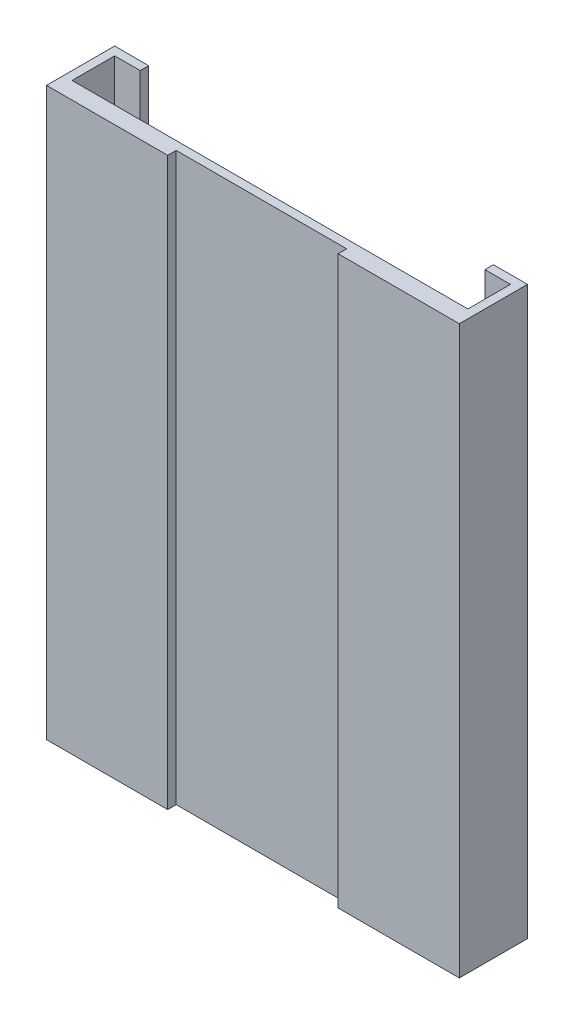
ISO-10303-21;
HEADER;
FILE_DESCRIPTION(('STEP AP214'),'2;1');
FILE_NAME('part.step','',(''),(''),'','','');
FILE_SCHEMA(('AUTOMOTIVE_DESIGN { 1 0 10303 214 1 1 1 1 }'));
ENDSEC;
DATA;
#1=APPLICATION_CONTEXT('core data for automotive mechanical design processes');
#2=APPLICATION_PROTOCOL_DEFINITION('international standard','automotive_design',2000,#1);
#3=PRODUCT_CONTEXT('',#1,'mechanical');
#4=PRODUCT('Part','Part','',(#3));
#5=PRODUCT_RELATED_PRODUCT_CATEGORY('part','',(#4));
#6=PRODUCT_DEFINITION_FORMATION('','',#4);
#7=PRODUCT_DEFINITION_CONTEXT('part definition',#1,'design');
#8=PRODUCT_DEFINITION('design','',#6,#7);
#9=PRODUCT_DEFINITION_SHAPE('','',#8);
#10=(LENGTH_UNIT() NAMED_UNIT(*) SI_UNIT(.MILLI.,.METRE.));
#11=(NAMED_UNIT(*) PLANE_ANGLE_UNIT() SI_UNIT($,.RADIAN.));
#12=(NAMED_UNIT(*) SI_UNIT($,.STERADIAN.) SOLID_ANGLE_UNIT());
#13=UNCERTAINTY_MEASURE_WITH_UNIT(LENGTH_MEASURE(1.E-05),#10,'distance_accuracy_value','');
#14=(GEOMETRIC_REPRESENTATION_CONTEXT(3) GLOBAL_UNCERTAINTY_ASSIGNED_CONTEXT((#13)) GLOBAL_UNIT_ASSIGNED_CONTEXT((#10,
#11,#12)) REPRESENTATION_CONTEXT('',''));
#15=CARTESIAN_POINT('',(0.,0.,0.));
#16=DIRECTION('',(0.,0.,1.));
#17=DIRECTION('',(1.,0.,0.));
#18=AXIS2_PLACEMENT_3D('',#15,#16,#17);
#19=CARTESIAN_POINT('',(0.,0.,-0.8));
#20=DIRECTION('',(0.,0.,1.));
#21=DIRECTION('',(1.,0.,0.));
#22=AXIS2_PLACEMENT_3D('',#19,#20,#21);
#23=PLANE('',#22);
#24=DIRECTION('',(0.,-1.,0.));
#25=VECTOR('',#24,1.);
#26=CARTESIAN_POINT('',(-3.32147029997593,13.3,-0.8));
#27=LINE('',#26,#25);
#28=CARTESIAN_POINT('',(-3.32147029997593,13.3,-0.8));
#29=VERTEX_POINT('',#28);
#30=CARTESIAN_POINT('',(-3.32147029997593,12.5,-0.8));
#31=VERTEX_POINT('',#30);
#32=EDGE_CURVE('E478',#29,#31,#27,.T.);
#33=ORIENTED_EDGE('',*,*,#32,.F.);
#34=DIRECTION('',(-1.,0.,0.));
#35=VECTOR('',#34,1.);
#36=CARTESIAN_POINT('',(-9.69,13.3,-0.8));
#37=LINE('',#36,#35);
#38=CARTESIAN_POINT('',(3.445,13.3,-0.8));
#39=VERTEX_POINT('',#38);
#40=EDGE_CURVE('E387',#39,#29,#37,.T.);
#41=ORIENTED_EDGE('',*,*,#40,.F.);
#42=DIRECTION('',(0.,1.,0.));
#43=VECTOR('',#42,1.);
#44=CARTESIAN_POINT('',(3.445,13.3,-0.8));
#45=LINE('',#44,#43);
#46=CARTESIAN_POINT('',(3.445,12.5,-0.8));
#47=VERTEX_POINT('',#46);
#48=EDGE_CURVE('E239',#47,#39,#45,.T.);
#49=ORIENTED_EDGE('',*,*,#48,.F.);
#50=DIRECTION('',(-1.,0.,0.));
#51=VECTOR('',#50,1.);
#52=CARTESIAN_POINT('',(5.445,12.5,-0.8));
#53=LINE('',#52,#51);
#54=CARTESIAN_POINT('',(5.445,12.5,-0.8));
#55=VERTEX_POINT('',#54);
#56=EDGE_CURVE('E243',#55,#47,#53,.T.);
#57=ORIENTED_EDGE('',*,*,#56,.F.);
#58=DIRECTION('',(0.,-1.,0.));
#59=VECTOR('',#58,1.);
#60=CARTESIAN_POINT('',(5.445,13.3,-0.8));
#61=LINE('',#60,#59);
#62=CARTESIAN_POINT('',(5.445,13.3,-0.8));
#63=VERTEX_POINT('',#62);
#64=EDGE_CURVE('E230',#63,#55,#61,.T.);
#65=ORIENTED_EDGE('',*,*,#64,.F.);
#66=CARTESIAN_POINT('',(9.29,13.3,-0.8));
#67=VERTEX_POINT('',#66);
#68=EDGE_CURVE('E382',#67,#63,#37,.T.);
#69=ORIENTED_EDGE('',*,*,#68,.F.);
#70=DIRECTION('',(0.,1.,0.));
#71=VECTOR('',#70,1.);
#72=CARTESIAN_POINT('',(9.29,13.3,-0.8));
#73=LINE('',#72,#71);
#74=CARTESIAN_POINT('',(9.29,-12.9,-0.8));
#75=VERTEX_POINT('',#74);
#76=EDGE_CURVE('E363',#75,#67,#73,.T.);
#77=ORIENTED_EDGE('',*,*,#76,.F.);
#78=DIRECTION('',(1.,0.,0.));
#79=VECTOR('',#78,1.);
#80=CARTESIAN_POINT('',(9.29,-12.9,-0.8));
#81=LINE('',#80,#79);
#82=CARTESIAN_POINT('',(-9.29,-12.9,-0.8));
#83=VERTEX_POINT('',#82);
#84=EDGE_CURVE('E70',#83,#75,#81,.T.);
#85=ORIENTED_EDGE('',*,*,#84,.F.);
#86=DIRECTION('',(0.,-1.,0.));
#87=VECTOR('',#86,1.);
#88=CARTESIAN_POINT('',(-9.29,13.3,-0.8));
#89=LINE('',#88,#87);
#90=CARTESIAN_POINT('',(-9.29,13.3,-0.8));
#91=VERTEX_POINT('',#90);
#92=EDGE_CURVE('E339',#91,#83,#89,.T.);
#93=ORIENTED_EDGE('',*,*,#92,.F.);
#94=CARTESIAN_POINT('',(-5.56852970002408,13.3,-0.8));
#95=VERTEX_POINT('',#94);
#96=EDGE_CURVE('E388',#95,#91,#37,.T.);
#97=ORIENTED_EDGE('',*,*,#96,.F.);
#98=DIRECTION('',(0.,1.,0.));
#99=VECTOR('',#98,1.);
#100=CARTESIAN_POINT('',(-5.56852970002408,13.3,-0.8));
#101=LINE('',#100,#99);
#102=CARTESIAN_POINT('',(-5.56852970002408,12.5,-0.8));
#103=VERTEX_POINT('',#102);
#104=EDGE_CURVE('E210',#103,#95,#101,.T.);
#105=ORIENTED_EDGE('',*,*,#104,.F.);
#106=DIRECTION('',(-1.,0.,0.));
#107=VECTOR('',#106,1.);
#108=CARTESIAN_POINT('',(-3.32147029997593,12.5,-0.8));
#109=LINE('',#108,#107);
#110=EDGE_CURVE('E223',#31,#103,#109,.T.);
#111=ORIENTED_EDGE('',*,*,#110,.F.);
#112=EDGE_LOOP('',(#33,#41,#49,#57,#65,#69,#77,#85,#93,#97,#105,#111));
#113=FACE_BOUND('',#112,.T.);
#114=ADVANCED_FACE('F47',(#113),#23,.F.);
#115=CARTESIAN_POINT('',(-9.29,13.3,-3.2));
#116=DIRECTION('',(-1.,0.,0.));
#117=DIRECTION('',(0.,-1.,0.));
#118=AXIS2_PLACEMENT_3D('',#115,#116,#117);
#119=PLANE('',#118);
#120=DIRECTION('',(0.,0.,1.));
#121=VECTOR('',#120,1.);
#122=CARTESIAN_POINT('',(-9.29,-12.9,-3.2));
#123=LINE('',#122,#121);
#124=CARTESIAN_POINT('',(-9.29,-12.9,-2.8));
#125=VERTEX_POINT('',#124);
#126=EDGE_CURVE('E263',#125,#83,#123,.T.);
#127=ORIENTED_EDGE('',*,*,#126,.F.);
#128=DIRECTION('',(0.,-1.,0.));
#129=VECTOR('',#128,1.);
#130=CARTESIAN_POINT('',(-9.29,-13.3,-2.8));
#131=LINE('',#130,#129);
#132=CARTESIAN_POINT('',(-9.29,13.3,-2.8));
#133=VERTEX_POINT('',#132);
#134=EDGE_CURVE('E278',#133,#125,#131,.T.);
#135=ORIENTED_EDGE('',*,*,#134,.F.);
#136=DIRECTION('',(0.,0.,1.));
#137=VECTOR('',#136,1.);
#138=CARTESIAN_POINT('',(-9.29,13.3,-3.2));
#139=LINE('',#138,#137);
#140=EDGE_CURVE('E357',#133,#91,#139,.T.);
#141=ORIENTED_EDGE('',*,*,#140,.T.);
#142=ORIENTED_EDGE('',*,*,#92,.T.);
#143=EDGE_LOOP('',(#127,#135,#141,#142));
#144=FACE_BOUND('',#143,.T.);
#145=ADVANCED_FACE('F457',(#144),#119,.F.);
#146=CARTESIAN_POINT('',(9.29,13.3,-3.2));
#147=DIRECTION('',(1.,0.,0.));
#148=DIRECTION('',(0.,1.,0.));
#149=AXIS2_PLACEMENT_3D('',#146,#147,#148);
#150=PLANE('',#149);
#151=DIRECTION('',(0.,0.,1.));
#152=VECTOR('',#151,1.);
#153=CARTESIAN_POINT('',(9.29,-12.9,-3.2));
#154=LINE('',#153,#152);
#155=CARTESIAN_POINT('',(9.29,-12.9,-2.8));
#156=VERTEX_POINT('',#155);
#157=EDGE_CURVE('E63',#156,#75,#154,.T.);
#158=ORIENTED_EDGE('',*,*,#157,.T.);
#159=ORIENTED_EDGE('',*,*,#76,.T.);
#160=DIRECTION('',(0.,0.,1.));
#161=VECTOR('',#160,1.);
#162=CARTESIAN_POINT('',(9.29,13.3,-3.2));
#163=LINE('',#162,#161);
#164=CARTESIAN_POINT('',(9.29,13.3,-2.8));
#165=VERTEX_POINT('',#164);
#166=EDGE_CURVE('E375',#165,#67,#163,.T.);
#167=ORIENTED_EDGE('',*,*,#166,.F.);
#168=DIRECTION('',(0.,1.,0.));
#169=VECTOR('',#168,1.);
#170=CARTESIAN_POINT('',(9.29,13.3,-2.8));
#171=LINE('',#170,#169);
#172=EDGE_CURVE('E295',#156,#165,#171,.T.);
#173=ORIENTED_EDGE('',*,*,#172,.F.);
#174=EDGE_LOOP('',(#158,#159,#167,#173));
#175=FACE_BOUND('',#174,.T.);
#176=ADVANCED_FACE('F449',(#175),#150,.F.);
#177=CARTESIAN_POINT('',(8.09,13.3,-2.8));
#178=DIRECTION('',(0.,0.,-1.));
#179=DIRECTION('',(0.,1.,0.));
#180=AXIS2_PLACEMENT_3D('',#177,#178,#179);
#181=PLANE('',#180);
#182=DIRECTION('',(-1.,0.,0.));
#183=VECTOR('',#182,1.);
#184=CARTESIAN_POINT('',(8.09,-12.9,-2.8));
#185=LINE('',#184,#183);
#186=CARTESIAN_POINT('',(8.09,-12.9,-2.8));
#187=VERTEX_POINT('',#186);
#188=EDGE_CURVE('E274',#156,#187,#185,.T.);
#189=ORIENTED_EDGE('',*,*,#188,.F.);
#190=ORIENTED_EDGE('',*,*,#172,.T.);
#191=DIRECTION('',(1.,0.,0.));
#192=VECTOR('',#191,1.);
#193=CARTESIAN_POINT('',(8.09,13.3,-2.8));
#194=LINE('',#193,#192);
#195=CARTESIAN_POINT('',(8.09,13.3,-2.8));
#196=VERTEX_POINT('',#195);
#197=EDGE_CURVE('E306',#196,#165,#194,.T.);
#198=ORIENTED_EDGE('',*,*,#197,.F.);
#199=DIRECTION('',(0.,1.,0.));
#200=VECTOR('',#199,1.);
#201=CARTESIAN_POINT('',(8.09,13.3,-2.8));
#202=LINE('',#201,#200);
#203=EDGE_CURVE('E299',#187,#196,#202,.T.);
#204=ORIENTED_EDGE('',*,*,#203,.F.);
#205=EDGE_LOOP('',(#189,#190,#198,#204));
#206=FACE_BOUND('',#205,.T.);
#207=ADVANCED_FACE('F446',(#206),#181,.F.);
#208=CARTESIAN_POINT('',(8.09,0.,0.));
#209=DIRECTION('',(-1.,0.,0.));
#210=DIRECTION('',(0.,-1.,0.));
#211=AXIS2_PLACEMENT_3D('',#208,#209,#210);
#212=PLANE('',#211);
#213=DIRECTION('',(0.,-1.,0.));
#214=VECTOR('',#213,1.);
#215=CARTESIAN_POINT('',(8.09,13.3,-3.2));
#216=LINE('',#215,#214);
#217=CARTESIAN_POINT('',(8.09,13.3,-3.2));
#218=VERTEX_POINT('',#217);
#219=CARTESIAN_POINT('',(8.09,-12.9,-3.2));
#220=VERTEX_POINT('',#219);
#221=EDGE_CURVE('E296',#218,#220,#216,.T.);
#222=ORIENTED_EDGE('',*,*,#221,.T.);
#223=DIRECTION('',(0.,0.,1.));
#224=VECTOR('',#223,1.);
#225=CARTESIAN_POINT('',(8.09,-12.9,0.));
#226=LINE('',#225,#224);
#227=EDGE_CURVE('E271',#220,#187,#226,.T.);
#228=ORIENTED_EDGE('',*,*,#227,.T.);
#229=ORIENTED_EDGE('',*,*,#203,.T.);
#230=DIRECTION('',(0.,0.,-1.));
#231=VECTOR('',#230,1.);
#232=CARTESIAN_POINT('',(8.09,13.3,-3.2));
#233=LINE('',#232,#231);
#234=EDGE_CURVE('E302',#196,#218,#233,.T.);
#235=ORIENTED_EDGE('',*,*,#234,.T.);
#236=EDGE_LOOP('',(#222,#228,#229,#235));
#237=FACE_BOUND('',#236,.T.);
#238=ADVANCED_FACE('F441',(#237),#212,.T.);
#239=CARTESIAN_POINT('',(-8.09000000000001,-13.3,-2.8));
#240=DIRECTION('',(0.,0.,-1.));
#241=DIRECTION('',(-1.,0.,0.));
#242=AXIS2_PLACEMENT_3D('',#239,#240,#241);
#243=PLANE('',#242);
#244=DIRECTION('',(-1.,0.,0.));
#245=VECTOR('',#244,1.);
#246=CARTESIAN_POINT('',(-8.09000000000001,-12.9,-2.8));
#247=LINE('',#246,#245);
#248=CARTESIAN_POINT('',(-8.09000000000001,-12.9,-2.8));
#249=VERTEX_POINT('',#248);
#250=EDGE_CURVE('E267',#249,#125,#247,.T.);
#251=ORIENTED_EDGE('',*,*,#250,.F.);
#252=DIRECTION('',(0.,-1.,0.));
#253=VECTOR('',#252,1.);
#254=CARTESIAN_POINT('',(-8.09000000000001,-13.3,-2.8));
#255=LINE('',#254,#253);
#256=CARTESIAN_POINT('',(-8.09,13.3,-2.8));
#257=VERTEX_POINT('',#256);
#258=EDGE_CURVE('E285',#257,#249,#255,.T.);
#259=ORIENTED_EDGE('',*,*,#258,.F.);
#260=DIRECTION('',(-1.,0.,0.));
#261=VECTOR('',#260,1.);
#262=CARTESIAN_POINT('',(-8.09,13.3,-2.8));
#263=LINE('',#262,#261);
#264=EDGE_CURVE('E289',#257,#133,#263,.T.);
#265=ORIENTED_EDGE('',*,*,#264,.T.);
#266=ORIENTED_EDGE('',*,*,#134,.T.);
#267=EDGE_LOOP('',(#251,#259,#265,#266));
#268=FACE_BOUND('',#267,.T.);
#269=ADVANCED_FACE('F460',(#268),#243,.F.);
#270=CARTESIAN_POINT('',(-8.09,0.,0.));
#271=DIRECTION('',(1.,0.,0.));
#272=DIRECTION('',(0.,1.,0.));
#273=AXIS2_PLACEMENT_3D('',#270,#271,#272);
#274=PLANE('',#273);
#275=ORIENTED_EDGE('',*,*,#258,.T.);
#276=DIRECTION('',(0.,0.,-1.));
#277=VECTOR('',#276,1.);
#278=CARTESIAN_POINT('',(-8.09000000000001,-12.9,0.));
#279=LINE('',#278,#277);
#280=CARTESIAN_POINT('',(-8.09000000000001,-12.9,-3.2));
#281=VERTEX_POINT('',#280);
#282=EDGE_CURVE('E11',#249,#281,#279,.T.);
#283=ORIENTED_EDGE('',*,*,#282,.T.);
#284=DIRECTION('',(0.,1.,0.));
#285=VECTOR('',#284,1.);
#286=CARTESIAN_POINT('',(-8.09000000000001,-13.3,-3.2));
#287=LINE('',#286,#285);
#288=CARTESIAN_POINT('',(-8.09,13.3,-3.2));
#289=VERTEX_POINT('',#288);
#290=EDGE_CURVE('E279',#281,#289,#287,.T.);
#291=ORIENTED_EDGE('',*,*,#290,.T.);
#292=DIRECTION('',(0.,0.,1.));
#293=VECTOR('',#292,1.);
#294=CARTESIAN_POINT('',(-8.09,13.3,-3.2));
#295=LINE('',#294,#293);
#296=EDGE_CURVE('E282',#289,#257,#295,.T.);
#297=ORIENTED_EDGE('',*,*,#296,.T.);
#298=EDGE_LOOP('',(#275,#283,#291,#297));
#299=FACE_BOUND('',#298,.T.);
#300=ADVANCED_FACE('F634',(#299),#274,.T.);
#301=CARTESIAN_POINT('',(0.,0.,0.));
#302=DIRECTION('',(0.,0.,1.));
#303=DIRECTION('',(1.,0.,0.));
#304=AXIS2_PLACEMENT_3D('',#301,#302,#303);
#305=PLANE('',#304);
#306=DIRECTION('',(0.,-1.,0.));
#307=VECTOR('',#306,1.);
#308=CARTESIAN_POINT('',(-4.,13.3,0.));
#309=LINE('',#308,#307);
#310=CARTESIAN_POINT('',(-4.,13.3,0.));
#311=VERTEX_POINT('',#310);
#312=CARTESIAN_POINT('',(-4.,-13.3,0.));
#313=VERTEX_POINT('',#312);
#314=EDGE_CURVE('E336',#311,#313,#309,.T.);
#315=ORIENTED_EDGE('',*,*,#314,.F.);
#316=DIRECTION('',(-1.,0.,0.));
#317=VECTOR('',#316,1.);
#318=CARTESIAN_POINT('',(-9.69,13.3,0.));
#319=LINE('',#318,#317);
#320=CARTESIAN_POINT('',(-9.69,13.3,0.));
#321=VERTEX_POINT('',#320);
#322=EDGE_CURVE('E392',#311,#321,#319,.T.);
#323=ORIENTED_EDGE('',*,*,#322,.T.);
#324=DIRECTION('',(0.,-1.,0.));
#325=VECTOR('',#324,1.);
#326=CARTESIAN_POINT('',(-9.69,13.3,0.));
#327=LINE('',#326,#325);
#328=CARTESIAN_POINT('',(-9.69,-13.3,0.));
#329=VERTEX_POINT('',#328);
#330=EDGE_CURVE('E397',#321,#329,#327,.T.);
#331=ORIENTED_EDGE('',*,*,#330,.T.);
#332=DIRECTION('',(1.,0.,0.));
#333=VECTOR('',#332,1.);
#334=CARTESIAN_POINT('',(-9.69,-13.3,0.));
#335=LINE('',#334,#333);
#336=EDGE_CURVE('E402',#329,#313,#335,.T.);
#337=ORIENTED_EDGE('',*,*,#336,.T.);
#338=EDGE_LOOP('',(#315,#323,#331,#337));
#339=FACE_BOUND('',#338,.T.);
#340=ADVANCED_FACE('F628',(#339),#305,.T.);
#341=CARTESIAN_POINT('',(9.69,13.3,-0.8));
#342=DIRECTION('',(1.,0.,0.));
#343=DIRECTION('',(0.,1.,0.));
#344=AXIS2_PLACEMENT_3D('',#341,#342,#343);
#345=PLANE('',#344);
#346=DIRECTION('',(0.,1.,0.));
#347=VECTOR('',#346,1.);
#348=CARTESIAN_POINT('',(9.69,13.3,0.));
#349=LINE('',#348,#347);
#350=CARTESIAN_POINT('',(9.69,-13.3,0.));
#351=VERTEX_POINT('',#350);
#352=CARTESIAN_POINT('',(9.69,13.3,0.));
#353=VERTEX_POINT('',#352);
#354=EDGE_CURVE('E381',#351,#353,#349,.T.);
#355=ORIENTED_EDGE('',*,*,#354,.F.);
#356=DIRECTION('',(0.,0.,1.));
#357=VECTOR('',#356,1.);
#358=CARTESIAN_POINT('',(9.69,-13.3,-0.8));
#359=LINE('',#358,#357);
#360=CARTESIAN_POINT('',(9.69,-13.3,-3.2));
#361=VERTEX_POINT('',#360);
#362=EDGE_CURVE('E56',#361,#351,#359,.T.);
#363=ORIENTED_EDGE('',*,*,#362,.F.);
#364=DIRECTION('',(0.,-1.,0.));
#365=VECTOR('',#364,1.);
#366=CARTESIAN_POINT('',(9.69,13.3,-3.2));
#367=LINE('',#366,#365);
#368=CARTESIAN_POINT('',(9.69,13.3,-3.2));
#369=VERTEX_POINT('',#368);
#370=EDGE_CURVE('E364',#369,#361,#367,.T.);
#371=ORIENTED_EDGE('',*,*,#370,.F.);
#372=DIRECTION('',(0.,0.,1.));
#373=VECTOR('',#372,1.);
#374=CARTESIAN_POINT('',(9.69,13.3,-0.8));
#375=LINE('',#374,#373);
#376=EDGE_CURVE('E386',#369,#353,#375,.T.);
#377=ORIENTED_EDGE('',*,*,#376,.T.);
#378=EDGE_LOOP('',(#355,#363,#371,#377));
#379=FACE_BOUND('',#378,.T.);
#380=ADVANCED_FACE('F49',(#379),#345,.T.);
#381=CARTESIAN_POINT('',(-9.69,-13.3,-0.8));
#382=DIRECTION('',(0.,-1.,0.));
#383=DIRECTION('',(0.,0.,-1.));
#384=AXIS2_PLACEMENT_3D('',#381,#382,#383);
#385=PLANE('',#384);
#386=DIRECTION('',(0.,0.,1.));
#387=VECTOR('',#386,1.);
#388=CARTESIAN_POINT('',(-9.69,-13.3,-0.8));
#389=LINE('',#388,#387);
#390=CARTESIAN_POINT('',(-9.69,-13.3,-3.2));
#391=VERTEX_POINT('',#390);
#392=EDGE_CURVE('E409',#391,#329,#389,.T.);
#393=ORIENTED_EDGE('',*,*,#392,.F.);
#394=DIRECTION('',(-1.,0.,0.));
#395=VECTOR('',#394,1.);
#396=CARTESIAN_POINT('',(9.69,-13.3,-3.2));
#397=LINE('',#396,#395);
#398=EDGE_CURVE('E368',#361,#391,#397,.T.);
#399=ORIENTED_EDGE('',*,*,#398,.F.);
#400=ORIENTED_EDGE('',*,*,#362,.T.);
#401=CARTESIAN_POINT('',(4.,-13.3,0.));
#402=VERTEX_POINT('',#401);
#403=EDGE_CURVE('E401',#402,#351,#335,.T.);
#404=ORIENTED_EDGE('',*,*,#403,.F.);
#405=DIRECTION('',(0.,0.,1.));
#406=VECTOR('',#405,1.);
#407=CARTESIAN_POINT('',(4.,-13.3,0.));
#408=LINE('',#407,#406);
#409=CARTESIAN_POINT('',(4.,-13.3,-0.399999999999999));
#410=VERTEX_POINT('',#409);
#411=EDGE_CURVE('E318',#410,#402,#408,.T.);
#412=ORIENTED_EDGE('',*,*,#411,.F.);
#413=DIRECTION('',(1.,0.,0.));
#414=VECTOR('',#413,1.);
#415=CARTESIAN_POINT('',(-4.,-13.3,-0.4));
#416=LINE('',#415,#414);
#417=CARTESIAN_POINT('',(-4.,-13.3,-0.4));
#418=VERTEX_POINT('',#417);
#419=EDGE_CURVE('E330',#418,#410,#416,.T.);
#420=ORIENTED_EDGE('',*,*,#419,.F.);
#421=DIRECTION('',(0.,0.,-1.));
#422=VECTOR('',#421,1.);
#423=CARTESIAN_POINT('',(-4.,-13.3,0.));
#424=LINE('',#423,#422);
#425=EDGE_CURVE('E312',#313,#418,#424,.T.);
#426=ORIENTED_EDGE('',*,*,#425,.F.);
#427=ORIENTED_EDGE('',*,*,#336,.F.);
#428=EDGE_LOOP('',(#393,#399,#400,#404,#412,#420,#426,#427));
#429=FACE_BOUND('',#428,.T.);
#430=ADVANCED_FACE('F433',(#429),#385,.T.);
#431=CARTESIAN_POINT('',(-9.69,13.3,-0.8));
#432=DIRECTION('',(-1.,0.,0.));
#433=DIRECTION('',(0.,-1.,0.));
#434=AXIS2_PLACEMENT_3D('',#431,#432,#433);
#435=PLANE('',#434);
#436=ORIENTED_EDGE('',*,*,#330,.F.);
#437=DIRECTION('',(0.,0.,1.));
#438=VECTOR('',#437,1.);
#439=CARTESIAN_POINT('',(-9.69,13.3,-0.8));
#440=LINE('',#439,#438);
#441=CARTESIAN_POINT('',(-9.69,13.3,-3.2));
#442=VERTEX_POINT('',#441);
#443=EDGE_CURVE('E412',#442,#321,#440,.T.);
#444=ORIENTED_EDGE('',*,*,#443,.F.);
#445=DIRECTION('',(0.,1.,0.));
#446=VECTOR('',#445,1.);
#447=CARTESIAN_POINT('',(-9.69,13.3,-3.2));
#448=LINE('',#447,#446);
#449=EDGE_CURVE('E349',#391,#442,#448,.T.);
#450=ORIENTED_EDGE('',*,*,#449,.F.);
#451=ORIENTED_EDGE('',*,*,#392,.T.);
#452=EDGE_LOOP('',(#436,#444,#450,#451));
#453=FACE_BOUND('',#452,.T.);
#454=ADVANCED_FACE('F631',(#453),#435,.T.);
#455=CARTESIAN_POINT('',(-9.69,13.3,-0.8));
#456=DIRECTION('',(0.,1.,0.));
#457=DIRECTION('',(0.,0.,1.));
#458=AXIS2_PLACEMENT_3D('',#455,#456,#457);
#459=PLANE('',#458);
#460=DIRECTION('',(-1.,0.,0.));
#461=VECTOR('',#460,1.);
#462=CARTESIAN_POINT('',(6.57637084989848,13.3,-0.8));
#463=LINE('',#462,#461);
#464=EDGE_CURVE('E219',#29,#95,#463,.T.);
#465=ORIENTED_EDGE('',*,*,#464,.T.);
#466=ORIENTED_EDGE('',*,*,#96,.T.);
#467=ORIENTED_EDGE('',*,*,#140,.F.);
#468=ORIENTED_EDGE('',*,*,#264,.F.);
#469=ORIENTED_EDGE('',*,*,#296,.F.);
#470=DIRECTION('',(1.,0.,0.));
#471=VECTOR('',#470,1.);
#472=CARTESIAN_POINT('',(-9.69,13.3,-3.2));
#473=LINE('',#472,#471);
#474=EDGE_CURVE('E353',#442,#289,#473,.T.);
#475=ORIENTED_EDGE('',*,*,#474,.F.);
#476=ORIENTED_EDGE('',*,*,#443,.T.);
#477=ORIENTED_EDGE('',*,*,#322,.F.);
#478=DIRECTION('',(0.,0.,-1.));
#479=VECTOR('',#478,1.);
#480=CARTESIAN_POINT('',(-4.,13.3,0.));
#481=LINE('',#480,#479);
#482=CARTESIAN_POINT('',(-4.,13.3,-0.4));
#483=VERTEX_POINT('',#482);
#484=EDGE_CURVE('E313',#311,#483,#481,.T.);
#485=ORIENTED_EDGE('',*,*,#484,.T.);
#486=DIRECTION('',(1.,0.,0.));
#487=VECTOR('',#486,1.);
#488=CARTESIAN_POINT('',(-4.,13.3,-0.4));
#489=LINE('',#488,#487);
#490=CARTESIAN_POINT('',(4.,13.3,-0.399999999999999));
#491=VERTEX_POINT('',#490);
#492=EDGE_CURVE('E317',#483,#491,#489,.T.);
#493=ORIENTED_EDGE('',*,*,#492,.T.);
#494=DIRECTION('',(0.,0.,1.));
#495=VECTOR('',#494,1.);
#496=CARTESIAN_POINT('',(4.,13.3,0.));
#497=LINE('',#496,#495);
#498=CARTESIAN_POINT('',(4.,13.3,0.));
#499=VERTEX_POINT('',#498);
#500=EDGE_CURVE('E322',#491,#499,#497,.T.);
#501=ORIENTED_EDGE('',*,*,#500,.T.);
#502=EDGE_CURVE('E393',#353,#499,#319,.T.);
#503=ORIENTED_EDGE('',*,*,#502,.F.);
#504=ORIENTED_EDGE('',*,*,#376,.F.);
#505=DIRECTION('',(1.,0.,0.));
#506=VECTOR('',#505,1.);
#507=CARTESIAN_POINT('',(9.69,13.3,-3.2));
#508=LINE('',#507,#506);
#509=EDGE_CURVE('E371',#218,#369,#508,.T.);
#510=ORIENTED_EDGE('',*,*,#509,.F.);
#511=ORIENTED_EDGE('',*,*,#234,.F.);
#512=ORIENTED_EDGE('',*,*,#197,.T.);
#513=ORIENTED_EDGE('',*,*,#166,.T.);
#514=ORIENTED_EDGE('',*,*,#68,.T.);
#515=EDGE_CURVE('E474',#63,#39,#463,.T.);
#516=ORIENTED_EDGE('',*,*,#515,.T.);
#517=ORIENTED_EDGE('',*,*,#40,.T.);
#518=EDGE_LOOP('',(#465,#466,#467,#468,#469,#475,#476,#477,#485,#493,#501,#503,#504,#510,#511,
#512,#513,#514,#516,#517));
#519=FACE_BOUND('',#518,.T.);
#520=ADVANCED_FACE('F423',(#519),#459,.T.);
#521=DIRECTION('',(0.,-1.,0.));
#522=VECTOR('',#521,1.);
#523=CARTESIAN_POINT('',(4.,13.3,0.));
#524=LINE('',#523,#522);
#525=EDGE_CURVE('E340',#499,#402,#524,.T.);
#526=ORIENTED_EDGE('',*,*,#525,.T.);
#527=ORIENTED_EDGE('',*,*,#403,.T.);
#528=ORIENTED_EDGE('',*,*,#354,.T.);
#529=ORIENTED_EDGE('',*,*,#502,.T.);
#530=EDGE_LOOP('',(#526,#527,#528,#529));
#531=FACE_BOUND('',#530,.T.);
#532=ADVANCED_FACE('F426',(#531),#305,.T.);
#533=CARTESIAN_POINT('',(0.,0.,-3.2));
#534=DIRECTION('',(0.,0.,-1.));
#535=DIRECTION('',(-1.,0.,0.));
#536=AXIS2_PLACEMENT_3D('',#533,#534,#535);
#537=PLANE('',#536);
#538=ORIENTED_EDGE('',*,*,#398,.T.);
#539=ORIENTED_EDGE('',*,*,#449,.T.);
#540=ORIENTED_EDGE('',*,*,#474,.T.);
#541=ORIENTED_EDGE('',*,*,#290,.F.);
#542=DIRECTION('',(1.,0.,0.));
#543=VECTOR('',#542,1.);
#544=CARTESIAN_POINT('',(9.29,-12.9,-3.2));
#545=LINE('',#544,#543);
#546=EDGE_CURVE('E255',#281,#220,#545,.T.);
#547=ORIENTED_EDGE('',*,*,#546,.T.);
#548=ORIENTED_EDGE('',*,*,#221,.F.);
#549=ORIENTED_EDGE('',*,*,#509,.T.);
#550=ORIENTED_EDGE('',*,*,#370,.T.);
#551=EDGE_LOOP('',(#538,#539,#540,#541,#547,#548,#549,#550));
#552=FACE_BOUND('',#551,.T.);
#553=ADVANCED_FACE('F437',(#552),#537,.T.);
#554=CARTESIAN_POINT('',(-4.,13.3,0.));
#555=DIRECTION('',(-1.,0.,0.));
#556=DIRECTION('',(0.,0.,1.));
#557=AXIS2_PLACEMENT_3D('',#554,#555,#556);
#558=PLANE('',#557);
#559=ORIENTED_EDGE('',*,*,#425,.T.);
#560=DIRECTION('',(0.,-1.,0.));
#561=VECTOR('',#560,1.);
#562=CARTESIAN_POINT('',(-4.,13.3,-0.4));
#563=LINE('',#562,#561);
#564=EDGE_CURVE('E326',#483,#418,#563,.T.);
#565=ORIENTED_EDGE('',*,*,#564,.F.);
#566=ORIENTED_EDGE('',*,*,#484,.F.);
#567=ORIENTED_EDGE('',*,*,#314,.T.);
#568=EDGE_LOOP('',(#559,#565,#566,#567));
#569=FACE_BOUND('',#568,.T.);
#570=ADVANCED_FACE('F801',(#569),#558,.F.);
#571=CARTESIAN_POINT('',(4.,13.3,0.));
#572=DIRECTION('',(1.,0.,0.));
#573=DIRECTION('',(0.,0.,-1.));
#574=AXIS2_PLACEMENT_3D('',#571,#572,#573);
#575=PLANE('',#574);
#576=ORIENTED_EDGE('',*,*,#411,.T.);
#577=ORIENTED_EDGE('',*,*,#525,.F.);
#578=ORIENTED_EDGE('',*,*,#500,.F.);
#579=DIRECTION('',(0.,-1.,0.));
#580=VECTOR('',#579,1.);
#581=CARTESIAN_POINT('',(4.,13.3,-0.399999999999999));
#582=LINE('',#581,#580);
#583=EDGE_CURVE('E344',#491,#410,#582,.T.);
#584=ORIENTED_EDGE('',*,*,#583,.T.);
#585=EDGE_LOOP('',(#576,#577,#578,#584));
#586=FACE_BOUND('',#585,.T.);
#587=ADVANCED_FACE('F791',(#586),#575,.F.);
#588=CARTESIAN_POINT('',(-4.,13.3,-0.4));
#589=DIRECTION('',(0.,0.,-1.));
#590=DIRECTION('',(-1.,0.,0.));
#591=AXIS2_PLACEMENT_3D('',#588,#589,#590);
#592=PLANE('',#591);
#593=ORIENTED_EDGE('',*,*,#419,.T.);
#594=ORIENTED_EDGE('',*,*,#583,.F.);
#595=ORIENTED_EDGE('',*,*,#492,.F.);
#596=ORIENTED_EDGE('',*,*,#564,.T.);
#597=EDGE_LOOP('',(#593,#594,#595,#596));
#598=FACE_BOUND('',#597,.T.);
#599=ADVANCED_FACE('F744',(#598),#592,.F.);
#600=CARTESIAN_POINT('',(9.29,-12.9,-3.2));
#601=DIRECTION('',(0.,-1.,0.));
#602=DIRECTION('',(0.,0.,-1.));
#603=AXIS2_PLACEMENT_3D('',#600,#601,#602);
#604=PLANE('',#603);
#605=ORIENTED_EDGE('',*,*,#157,.F.);
#606=ORIENTED_EDGE('',*,*,#188,.T.);
#607=ORIENTED_EDGE('',*,*,#227,.F.);
#608=ORIENTED_EDGE('',*,*,#546,.F.);
#609=ORIENTED_EDGE('',*,*,#282,.F.);
#610=ORIENTED_EDGE('',*,*,#250,.T.);
#611=ORIENTED_EDGE('',*,*,#126,.T.);
#612=ORIENTED_EDGE('',*,*,#84,.T.);
#613=EDGE_LOOP('',(#605,#606,#607,#608,#609,#610,#611,#612));
#614=FACE_BOUND('',#613,.T.);
#615=ADVANCED_FACE('F453',(#614),#604,.F.);
#616=CARTESIAN_POINT('',(5.445,13.3,-1.6));
#617=DIRECTION('',(-1.,0.,0.));
#618=DIRECTION('',(0.,0.,1.));
#619=AXIS2_PLACEMENT_3D('',#616,#617,#618);
#620=PLANE('',#619);
#621=DIRECTION('',(0.,0.,1.));
#622=VECTOR('',#621,1.);
#623=CARTESIAN_POINT('',(5.445,12.5,-1.6));
#624=LINE('',#623,#622);
#625=CARTESIAN_POINT('',(5.445,12.5,-1.6));
#626=VERTEX_POINT('',#625);
#627=EDGE_CURVE('E252',#626,#55,#624,.T.);
#628=ORIENTED_EDGE('',*,*,#627,.F.);
#629=DIRECTION('',(0.,-0.707106781186548,-0.707106781186547));
#630=VECTOR('',#629,1.);
#631=CARTESIAN_POINT('',(5.445,12.5,-1.6));
#632=LINE('',#631,#630);
#633=EDGE_CURVE('E492',#63,#626,#632,.T.);
#634=ORIENTED_EDGE('',*,*,#633,.F.);
#635=ORIENTED_EDGE('',*,*,#64,.T.);
#636=EDGE_LOOP('',(#628,#634,#635));
#637=FACE_BOUND('',#636,.T.);
#638=ADVANCED_FACE('F667',(#637),#620,.F.);
#639=CARTESIAN_POINT('',(5.445,12.5,-1.6));
#640=DIRECTION('',(0.,1.,0.));
#641=DIRECTION('',(0.,0.,1.));
#642=AXIS2_PLACEMENT_3D('',#639,#640,#641);
#643=PLANE('',#642);
#644=ORIENTED_EDGE('',*,*,#56,.T.);
#645=DIRECTION('',(0.,0.,1.));
#646=VECTOR('',#645,1.);
#647=CARTESIAN_POINT('',(3.445,12.5,-1.6));
#648=LINE('',#647,#646);
#649=CARTESIAN_POINT('',(3.445,12.5,-1.6));
#650=VERTEX_POINT('',#649);
#651=EDGE_CURVE('E238',#650,#47,#648,.T.);
#652=ORIENTED_EDGE('',*,*,#651,.F.);
#653=DIRECTION('',(-1.,0.,0.));
#654=VECTOR('',#653,1.);
#655=CARTESIAN_POINT('',(5.445,12.5,-1.6));
#656=LINE('',#655,#654);
#657=EDGE_CURVE('E235',#626,#650,#656,.T.);
#658=ORIENTED_EDGE('',*,*,#657,.F.);
#659=ORIENTED_EDGE('',*,*,#627,.T.);
#660=EDGE_LOOP('',(#644,#652,#658,#659));
#661=FACE_BOUND('',#660,.T.);
#662=ADVANCED_FACE('F671',(#661),#643,.F.);
#663=CARTESIAN_POINT('',(3.445,13.3,-1.6));
#664=DIRECTION('',(1.,0.,0.));
#665=DIRECTION('',(0.,0.,-1.));
#666=AXIS2_PLACEMENT_3D('',#663,#664,#665);
#667=PLANE('',#666);
#668=ORIENTED_EDGE('',*,*,#48,.T.);
#669=DIRECTION('',(0.,-0.707106781186548,-0.707106781186547));
#670=VECTOR('',#669,1.);
#671=CARTESIAN_POINT('',(3.445,12.9,-1.2));
#672=LINE('',#671,#670);
#673=EDGE_CURVE('E481',#39,#650,#672,.T.);
#674=ORIENTED_EDGE('',*,*,#673,.T.);
#675=ORIENTED_EDGE('',*,*,#651,.T.);
#676=EDGE_LOOP('',(#668,#674,#675));
#677=FACE_BOUND('',#676,.T.);
#678=ADVANCED_FACE('F680',(#677),#667,.F.);
#679=CARTESIAN_POINT('',(-3.32147029997593,13.3,-1.6));
#680=DIRECTION('',(-1.,0.,0.));
#681=DIRECTION('',(0.,0.,1.));
#682=AXIS2_PLACEMENT_3D('',#679,#680,#681);
#683=PLANE('',#682);
#684=DIRECTION('',(0.,0.,1.));
#685=VECTOR('',#684,1.);
#686=CARTESIAN_POINT('',(-3.32147029997593,12.5,-1.6));
#687=LINE('',#686,#685);
#688=CARTESIAN_POINT('',(-3.32147029997593,12.5,-1.6));
#689=VERTEX_POINT('',#688);
#690=EDGE_CURVE('E225',#689,#31,#687,.T.);
#691=ORIENTED_EDGE('',*,*,#690,.F.);
#692=DIRECTION('',(0.,0.707106781186548,0.707106781186547));
#693=VECTOR('',#692,1.);
#694=CARTESIAN_POINT('',(-3.32147029997593,12.9,-1.2));
#695=LINE('',#694,#693);
#696=EDGE_CURVE('E204',#689,#29,#695,.T.);
#697=ORIENTED_EDGE('',*,*,#696,.T.);
#698=ORIENTED_EDGE('',*,*,#32,.T.);
#699=EDGE_LOOP('',(#691,#697,#698));
#700=FACE_BOUND('',#699,.T.);
#701=ADVANCED_FACE('F689',(#700),#683,.F.);
#702=CARTESIAN_POINT('',(-3.32147029997593,12.5,-1.6));
#703=DIRECTION('',(0.,1.,0.));
#704=DIRECTION('',(0.,0.,1.));
#705=AXIS2_PLACEMENT_3D('',#702,#703,#704);
#706=PLANE('',#705);
#707=ORIENTED_EDGE('',*,*,#110,.T.);
#708=DIRECTION('',(0.,0.,1.));
#709=VECTOR('',#708,1.);
#710=CARTESIAN_POINT('',(-5.56852970002408,12.5,-1.6));
#711=LINE('',#710,#709);
#712=CARTESIAN_POINT('',(-5.56852970002408,12.5,-1.6));
#713=VERTEX_POINT('',#712);
#714=EDGE_CURVE('E209',#713,#103,#711,.T.);
#715=ORIENTED_EDGE('',*,*,#714,.F.);
#716=DIRECTION('',(-1.,0.,0.));
#717=VECTOR('',#716,1.);
#718=CARTESIAN_POINT('',(-3.32147029997593,12.5,-1.6));
#719=LINE('',#718,#717);
#720=EDGE_CURVE('E198',#689,#713,#719,.T.);
#721=ORIENTED_EDGE('',*,*,#720,.F.);
#722=ORIENTED_EDGE('',*,*,#690,.T.);
#723=EDGE_LOOP('',(#707,#715,#721,#722));
#724=FACE_BOUND('',#723,.T.);
#725=ADVANCED_FACE('F221',(#724),#706,.F.);
#726=CARTESIAN_POINT('',(-5.56852970002408,13.3,-1.6));
#727=DIRECTION('',(1.,0.,0.));
#728=DIRECTION('',(0.,0.,-1.));
#729=AXIS2_PLACEMENT_3D('',#726,#727,#728);
#730=PLANE('',#729);
#731=ORIENTED_EDGE('',*,*,#104,.T.);
#732=DIRECTION('',(0.,0.707106781186548,0.707106781186547));
#733=VECTOR('',#732,1.);
#734=CARTESIAN_POINT('',(-5.56852970002408,12.5,-1.6));
#735=LINE('',#734,#733);
#736=EDGE_CURVE('E201',#713,#95,#735,.T.);
#737=ORIENTED_EDGE('',*,*,#736,.F.);
#738=ORIENTED_EDGE('',*,*,#714,.T.);
#739=EDGE_LOOP('',(#731,#737,#738));
#740=FACE_BOUND('',#739,.T.);
#741=ADVANCED_FACE('F215',(#740),#730,.F.);
#742=CARTESIAN_POINT('',(6.57637084989848,12.5,-1.6));
#743=DIRECTION('',(0.,-0.707106781186548,0.707106781186548));
#744=DIRECTION('',(0.,-0.707106781186548,-0.707106781186547));
#745=AXIS2_PLACEMENT_3D('',#742,#743,#744);
#746=PLANE('',#745);
#747=ORIENTED_EDGE('',*,*,#720,.T.);
#748=ORIENTED_EDGE('',*,*,#736,.T.);
#749=ORIENTED_EDGE('',*,*,#464,.F.);
#750=ORIENTED_EDGE('',*,*,#696,.F.);
#751=EDGE_LOOP('',(#747,#748,#749,#750));
#752=FACE_BOUND('',#751,.T.);
#753=ADVANCED_FACE('F200',(#752),#746,.F.);
#754=ORIENTED_EDGE('',*,*,#515,.F.);
#755=ORIENTED_EDGE('',*,*,#633,.T.);
#756=ORIENTED_EDGE('',*,*,#657,.T.);
#757=ORIENTED_EDGE('',*,*,#673,.F.);
#758=EDGE_LOOP('',(#754,#755,#756,#757));
#759=FACE_BOUND('',#758,.T.);
#760=ADVANCED_FACE('F718',(#759),#746,.F.);
#761=CLOSED_SHELL('',(#114,#145,#176,#207,#238,#269,#300,#340,#380,#430,#454,#520,#532,#553,
#570,#587,#599,#615,#638,#662,#678,#701,#725,#741,#753,#760));
#762=MANIFOLD_SOLID_BREP('B2',#761);
#763=ADVANCED_BREP_SHAPE_REPRESENTATION('',(#18,#762),#14);
#764=SHAPE_DEFINITION_REPRESENTATION(#9,#763);
ENDSEC;
END-ISO-10303-21;
